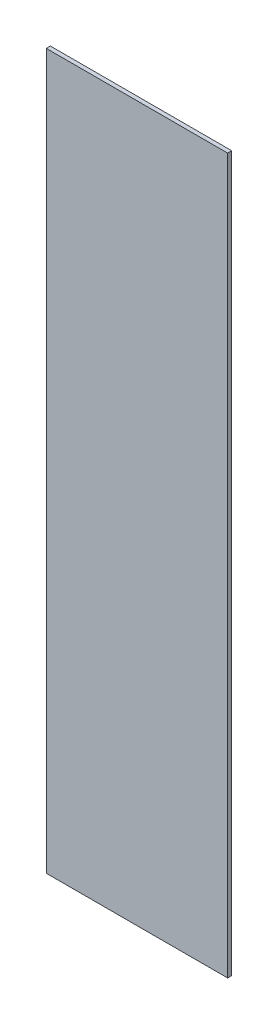
ISO-10303-21;
HEADER;
FILE_DESCRIPTION(('STEP AP214'),'2;1');
FILE_NAME('part.step','',(''),(''),'','','');
FILE_SCHEMA(('AUTOMOTIVE_DESIGN { 1 0 10303 214 1 1 1 1 }'));
ENDSEC;
DATA;
#1=APPLICATION_CONTEXT('core data for automotive mechanical design processes');
#2=APPLICATION_PROTOCOL_DEFINITION('international standard','automotive_design',2000,#1);
#3=PRODUCT_CONTEXT('',#1,'mechanical');
#4=PRODUCT('Part','Part','',(#3));
#5=PRODUCT_RELATED_PRODUCT_CATEGORY('part','',(#4));
#6=PRODUCT_DEFINITION_FORMATION('','',#4);
#7=PRODUCT_DEFINITION_CONTEXT('part definition',#1,'design');
#8=PRODUCT_DEFINITION('design','',#6,#7);
#9=PRODUCT_DEFINITION_SHAPE('','',#8);
#10=(LENGTH_UNIT() NAMED_UNIT(*) SI_UNIT(.MILLI.,.METRE.));
#11=(NAMED_UNIT(*) PLANE_ANGLE_UNIT() SI_UNIT($,.RADIAN.));
#12=(NAMED_UNIT(*) SI_UNIT($,.STERADIAN.) SOLID_ANGLE_UNIT());
#13=UNCERTAINTY_MEASURE_WITH_UNIT(LENGTH_MEASURE(1.E-05),#10,'distance_accuracy_value','');
#14=(GEOMETRIC_REPRESENTATION_CONTEXT(3) GLOBAL_UNCERTAINTY_ASSIGNED_CONTEXT((#13)) GLOBAL_UNIT_ASSIGNED_CONTEXT((#10,
#11,#12)) REPRESENTATION_CONTEXT('',''));
#15=CARTESIAN_POINT('',(0.,0.,0.));
#16=DIRECTION('',(0.,0.,1.));
#17=DIRECTION('',(1.,0.,0.));
#18=AXIS2_PLACEMENT_3D('',#15,#16,#17);
#19=CARTESIAN_POINT('',(-0.16597437697395,0.85207054274705,0.00045));
#20=DIRECTION('',(0.,1.,0.));
#21=DIRECTION('',(0.,0.,1.));
#22=AXIS2_PLACEMENT_3D('',#19,#20,#21);
#23=PLANE('',#22);
#24=DIRECTION('',(0.,0.,1.));
#25=VECTOR('',#24,1.);
#26=CARTESIAN_POINT('',(-0.17597628419895,0.85207054274705,0.));
#27=LINE('',#26,#25);
#28=CARTESIAN_POINT('',(-0.17597628419895,0.85207054274705,0.));
#29=VERTEX_POINT('',#28);
#30=CARTESIAN_POINT('',(-0.17597628419895,0.85207054274705,0.00045));
#31=VERTEX_POINT('',#30);
#32=EDGE_CURVE('E11',#29,#31,#27,.T.);
#33=ORIENTED_EDGE('',*,*,#32,.T.);
#34=DIRECTION('',(1.,0.,0.));
#35=VECTOR('',#34,1.);
#36=CARTESIAN_POINT('',(-0.17597628419895,0.85207054274705,0.00045));
#37=LINE('',#36,#35);
#38=CARTESIAN_POINT('',(-0.15597246974895,0.85207054274705,0.00045));
#39=VERTEX_POINT('',#38);
#40=EDGE_CURVE('E86',#31,#39,#37,.T.);
#41=ORIENTED_EDGE('',*,*,#40,.T.);
#42=DIRECTION('',(0.,0.,1.));
#43=VECTOR('',#42,1.);
#44=CARTESIAN_POINT('',(-0.15597246974895,0.85207054274705,0.));
#45=LINE('',#44,#43);
#46=CARTESIAN_POINT('',(-0.15597246974895,0.85207054274705,0.));
#47=VERTEX_POINT('',#46);
#48=EDGE_CURVE('E24',#47,#39,#45,.T.);
#49=ORIENTED_EDGE('',*,*,#48,.F.);
#50=DIRECTION('',(1.,0.,0.));
#51=VECTOR('',#50,1.);
#52=CARTESIAN_POINT('',(-0.17597628419895,0.85207054274705,0.));
#53=LINE('',#52,#51);
#54=EDGE_CURVE('E80',#29,#47,#53,.T.);
#55=ORIENTED_EDGE('',*,*,#54,.F.);
#56=EDGE_LOOP('',(#33,#41,#49,#55));
#57=FACE_BOUND('',#56,.T.);
#58=ADVANCED_FACE('F17',(#57),#23,.T.);
#59=CARTESIAN_POINT('',(-0.15597246974895,0.8126754605645,0.00045));
#60=DIRECTION('',(1.,0.,0.));
#61=DIRECTION('',(0.,0.,-1.));
#62=AXIS2_PLACEMENT_3D('',#59,#60,#61);
#63=PLANE('',#62);
#64=ORIENTED_EDGE('',*,*,#48,.T.);
#65=DIRECTION('',(0.,-1.,0.));
#66=VECTOR('',#65,1.);
#67=CARTESIAN_POINT('',(-0.15597246974895,0.85207054274705,0.00045));
#68=LINE('',#67,#66);
#69=CARTESIAN_POINT('',(-0.15597246974895,0.77328037838195,0.00045));
#70=VERTEX_POINT('',#69);
#71=EDGE_CURVE('E64',#39,#70,#68,.T.);
#72=ORIENTED_EDGE('',*,*,#71,.T.);
#73=DIRECTION('',(0.,0.,1.));
#74=VECTOR('',#73,1.);
#75=CARTESIAN_POINT('',(-0.15597246974895,0.77328037838195,0.));
#76=LINE('',#75,#74);
#77=CARTESIAN_POINT('',(-0.15597246974895,0.77328037838195,0.));
#78=VERTEX_POINT('',#77);
#79=EDGE_CURVE('E84',#78,#70,#76,.T.);
#80=ORIENTED_EDGE('',*,*,#79,.F.);
#81=DIRECTION('',(0.,-1.,0.));
#82=VECTOR('',#81,1.);
#83=CARTESIAN_POINT('',(-0.15597246974895,0.85207054274705,0.));
#84=LINE('',#83,#82);
#85=EDGE_CURVE('E72',#47,#78,#84,.T.);
#86=ORIENTED_EDGE('',*,*,#85,.F.);
#87=EDGE_LOOP('',(#64,#72,#80,#86));
#88=FACE_BOUND('',#87,.T.);
#89=ADVANCED_FACE('F91',(#88),#63,.T.);
#90=CARTESIAN_POINT('',(-0.16597437697395,0.77328037838195,0.00045));
#91=DIRECTION('',(0.,-1.,0.));
#92=DIRECTION('',(0.,0.,-1.));
#93=AXIS2_PLACEMENT_3D('',#90,#91,#92);
#94=PLANE('',#93);
#95=ORIENTED_EDGE('',*,*,#79,.T.);
#96=DIRECTION('',(-1.,0.,0.));
#97=VECTOR('',#96,1.);
#98=CARTESIAN_POINT('',(-0.15597246974895,0.77328037838195,0.00045));
#99=LINE('',#98,#97);
#100=CARTESIAN_POINT('',(-0.17597628419895,0.77328037838195,0.00045));
#101=VERTEX_POINT('',#100);
#102=EDGE_CURVE('E60',#70,#101,#99,.T.);
#103=ORIENTED_EDGE('',*,*,#102,.T.);
#104=DIRECTION('',(0.,0.,1.));
#105=VECTOR('',#104,1.);
#106=CARTESIAN_POINT('',(-0.17597628419895,0.77328037838195,0.));
#107=LINE('',#106,#105);
#108=CARTESIAN_POINT('',(-0.17597628419895,0.77328037838195,0.));
#109=VERTEX_POINT('',#108);
#110=EDGE_CURVE('E55',#109,#101,#107,.T.);
#111=ORIENTED_EDGE('',*,*,#110,.F.);
#112=DIRECTION('',(-1.,0.,0.));
#113=VECTOR('',#112,1.);
#114=CARTESIAN_POINT('',(-0.15597246974895,0.77328037838195,0.));
#115=LINE('',#114,#113);
#116=EDGE_CURVE('E58',#78,#109,#115,.T.);
#117=ORIENTED_EDGE('',*,*,#116,.F.);
#118=EDGE_LOOP('',(#95,#103,#111,#117));
#119=FACE_BOUND('',#118,.T.);
#120=ADVANCED_FACE('F57',(#119),#94,.T.);
#121=CARTESIAN_POINT('',(-0.17597628419895,0.8126754605645,0.00045));
#122=DIRECTION('',(-1.,0.,0.));
#123=DIRECTION('',(0.,0.,1.));
#124=AXIS2_PLACEMENT_3D('',#121,#122,#123);
#125=PLANE('',#124);
#126=ORIENTED_EDGE('',*,*,#110,.T.);
#127=DIRECTION('',(0.,1.,0.));
#128=VECTOR('',#127,1.);
#129=CARTESIAN_POINT('',(-0.17597628419895,0.77328037838195,0.00045));
#130=LINE('',#129,#128);
#131=EDGE_CURVE('E78',#101,#31,#130,.T.);
#132=ORIENTED_EDGE('',*,*,#131,.T.);
#133=ORIENTED_EDGE('',*,*,#32,.F.);
#134=DIRECTION('',(0.,1.,0.));
#135=VECTOR('',#134,1.);
#136=CARTESIAN_POINT('',(-0.17597628419895,0.77328037838195,0.));
#137=LINE('',#136,#135);
#138=EDGE_CURVE('E71',#109,#29,#137,.T.);
#139=ORIENTED_EDGE('',*,*,#138,.F.);
#140=EDGE_LOOP('',(#126,#132,#133,#139));
#141=FACE_BOUND('',#140,.T.);
#142=ADVANCED_FACE('F74',(#141),#125,.T.);
#143=CARTESIAN_POINT('',(-0.16597437697395,0.77328037838195,0.));
#144=DIRECTION('',(0.,0.,1.));
#145=DIRECTION('',(1.,0.,0.));
#146=AXIS2_PLACEMENT_3D('',#143,#144,#145);
#147=PLANE('',#146);
#148=ORIENTED_EDGE('',*,*,#54,.T.);
#149=ORIENTED_EDGE('',*,*,#85,.T.);
#150=ORIENTED_EDGE('',*,*,#116,.T.);
#151=ORIENTED_EDGE('',*,*,#138,.T.);
#152=EDGE_LOOP('',(#148,#149,#150,#151));
#153=FACE_BOUND('',#152,.T.);
#154=ADVANCED_FACE('F70',(#153),#147,.F.);
#155=CARTESIAN_POINT('',(-0.16597437697395,0.77328037838195,0.00045));
#156=DIRECTION('',(0.,0.,1.));
#157=DIRECTION('',(1.,0.,0.));
#158=AXIS2_PLACEMENT_3D('',#155,#156,#157);
#159=PLANE('',#158);
#160=ORIENTED_EDGE('',*,*,#40,.F.);
#161=ORIENTED_EDGE('',*,*,#131,.F.);
#162=ORIENTED_EDGE('',*,*,#102,.F.);
#163=ORIENTED_EDGE('',*,*,#71,.F.);
#164=EDGE_LOOP('',(#160,#161,#162,#163));
#165=FACE_BOUND('',#164,.T.);
#166=ADVANCED_FACE('F90',(#165),#159,.T.);
#167=CLOSED_SHELL('',(#58,#89,#120,#142,#154,#166));
#168=MANIFOLD_SOLID_BREP('B1',#167);
#169=ADVANCED_BREP_SHAPE_REPRESENTATION('',(#18,#168),#14);
#170=SHAPE_DEFINITION_REPRESENTATION(#9,#169);
ENDSEC;
END-ISO-10303-21;
